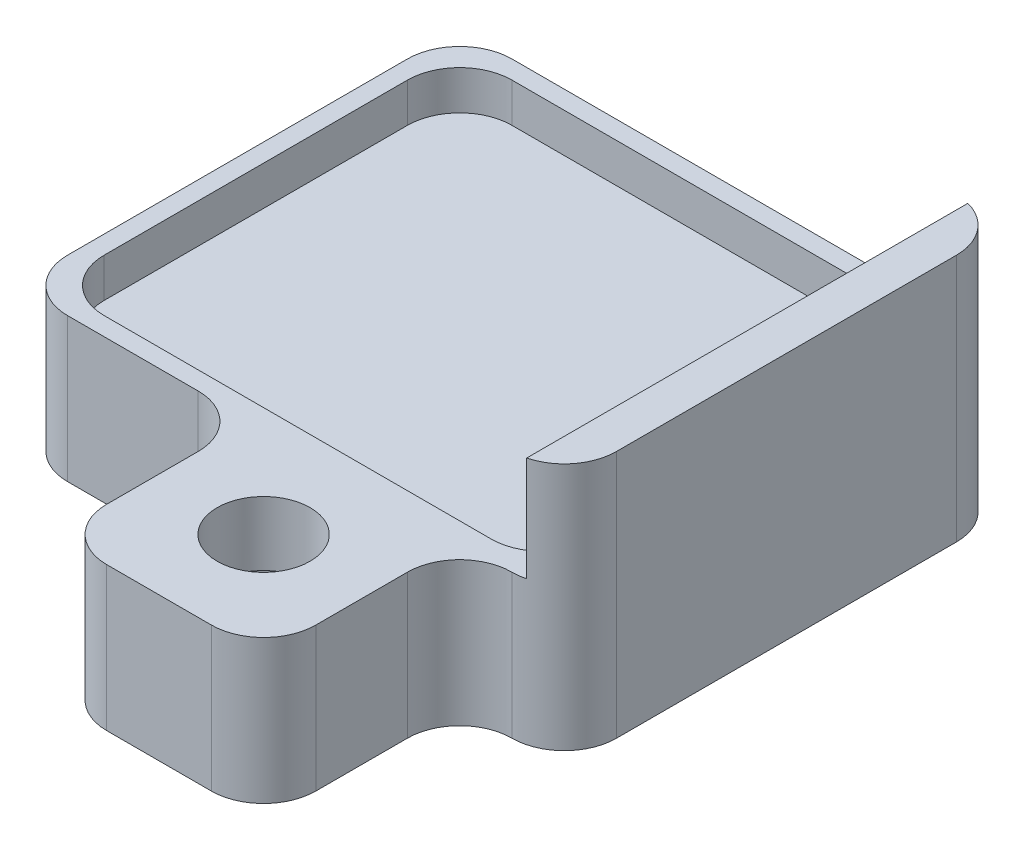
ISO-10303-21;
HEADER;
FILE_DESCRIPTION(('STEP AP214'),'2;1');
FILE_NAME('part.step','',(''),(''),'','','');
FILE_SCHEMA(('AUTOMOTIVE_DESIGN { 1 0 10303 214 1 1 1 1 }'));
ENDSEC;
DATA;
#1=APPLICATION_CONTEXT('core data for automotive mechanical design processes');
#2=APPLICATION_PROTOCOL_DEFINITION('international standard','automotive_design',2000,#1);
#3=PRODUCT_CONTEXT('',#1,'mechanical');
#4=PRODUCT('Part','Part','',(#3));
#5=PRODUCT_RELATED_PRODUCT_CATEGORY('part','',(#4));
#6=PRODUCT_DEFINITION_FORMATION('','',#4);
#7=PRODUCT_DEFINITION_CONTEXT('part definition',#1,'design');
#8=PRODUCT_DEFINITION('design','',#6,#7);
#9=PRODUCT_DEFINITION_SHAPE('','',#8);
#10=(LENGTH_UNIT() NAMED_UNIT(*) SI_UNIT(.MILLI.,.METRE.));
#11=(NAMED_UNIT(*) PLANE_ANGLE_UNIT() SI_UNIT($,.RADIAN.));
#12=(NAMED_UNIT(*) SI_UNIT($,.STERADIAN.) SOLID_ANGLE_UNIT());
#13=UNCERTAINTY_MEASURE_WITH_UNIT(LENGTH_MEASURE(1.E-05),#10,'distance_accuracy_value','');
#14=(GEOMETRIC_REPRESENTATION_CONTEXT(3) GLOBAL_UNCERTAINTY_ASSIGNED_CONTEXT((#13)) GLOBAL_UNIT_ASSIGNED_CONTEXT((#10,
#11,#12)) REPRESENTATION_CONTEXT('',''));
#15=CARTESIAN_POINT('',(0.,0.,0.));
#16=DIRECTION('',(0.,0.,1.));
#17=DIRECTION('',(1.,0.,0.));
#18=AXIS2_PLACEMENT_3D('',#15,#16,#17);
#19=CARTESIAN_POINT('',(-5.25,4.75,4.25));
#20=DIRECTION('',(0.,0.,-1.));
#21=DIRECTION('',(-1.,0.,0.));
#22=AXIS2_PLACEMENT_3D('',#19,#20,#21);
#23=PLANE('',#22);
#24=DIRECTION('',(1.,0.,0.));
#25=VECTOR('',#24,1.);
#26=CARTESIAN_POINT('',(-5.25,0.,4.25));
#27=LINE('',#26,#25);
#28=CARTESIAN_POINT('',(-4.25,0.,4.25));
#29=VERTEX_POINT('',#28);
#30=CARTESIAN_POINT('',(-1.75,0.,4.25));
#31=VERTEX_POINT('',#30);
#32=EDGE_CURVE('E369',#29,#31,#27,.T.);
#33=ORIENTED_EDGE('',*,*,#32,.T.);
#34=DIRECTION('',(0.,-1.,0.));
#35=VECTOR('',#34,1.);
#36=CARTESIAN_POINT('',(-1.75,2.75,4.25));
#37=LINE('',#36,#35);
#38=CARTESIAN_POINT('',(-1.75,2.75,4.25));
#39=VERTEX_POINT('',#38);
#40=EDGE_CURVE('E296',#31,#39,#37,.F.);
#41=ORIENTED_EDGE('',*,*,#40,.T.);
#42=DIRECTION('',(1.,0.,0.));
#43=VECTOR('',#42,1.);
#44=CARTESIAN_POINT('',(-5.25,2.75,4.25));
#45=LINE('',#44,#43);
#46=CARTESIAN_POINT('',(-4.25,2.75,4.25));
#47=VERTEX_POINT('',#46);
#48=EDGE_CURVE('E259',#47,#39,#45,.T.);
#49=ORIENTED_EDGE('',*,*,#48,.F.);
#50=DIRECTION('',(0.,-1.,0.));
#51=VECTOR('',#50,1.);
#52=CARTESIAN_POINT('',(-4.25,4.75,4.25));
#53=LINE('',#52,#51);
#54=EDGE_CURVE('E293',#47,#29,#53,.T.);
#55=ORIENTED_EDGE('',*,*,#54,.T.);
#56=EDGE_LOOP('',(#33,#41,#49,#55));
#57=FACE_BOUND('',#56,.T.);
#58=ADVANCED_FACE('F31',(#57),#23,.F.);
#59=CARTESIAN_POINT('',(-5.25,4.75,4.25));
#60=DIRECTION('',(1.,0.,0.));
#61=DIRECTION('',(0.,0.,-1.));
#62=AXIS2_PLACEMENT_3D('',#59,#60,#61);
#63=PLANE('',#62);
#64=DIRECTION('',(0.,0.,1.));
#65=VECTOR('',#64,1.);
#66=CARTESIAN_POINT('',(-5.25,2.75,-4.25));
#67=LINE('',#66,#65);
#68=CARTESIAN_POINT('',(-5.25,2.75,-3.25));
#69=VERTEX_POINT('',#68);
#70=CARTESIAN_POINT('',(-5.25,2.75,3.25));
#71=VERTEX_POINT('',#70);
#72=EDGE_CURVE('E353',#69,#71,#67,.T.);
#73=ORIENTED_EDGE('',*,*,#72,.F.);
#74=DIRECTION('',(0.,-1.,0.));
#75=VECTOR('',#74,1.);
#76=CARTESIAN_POINT('',(-5.25,4.75,-3.25));
#77=LINE('',#76,#75);
#78=CARTESIAN_POINT('',(-5.25,0.,-3.25));
#79=VERTEX_POINT('',#78);
#80=EDGE_CURVE('E290',#69,#79,#77,.T.);
#81=ORIENTED_EDGE('',*,*,#80,.T.);
#82=DIRECTION('',(0.,0.,1.));
#83=VECTOR('',#82,1.);
#84=CARTESIAN_POINT('',(-5.25,0.,4.25));
#85=LINE('',#84,#83);
#86=CARTESIAN_POINT('',(-5.25,0.,3.25));
#87=VERTEX_POINT('',#86);
#88=EDGE_CURVE('E374',#79,#87,#85,.T.);
#89=ORIENTED_EDGE('',*,*,#88,.T.);
#90=DIRECTION('',(0.,-1.,0.));
#91=VECTOR('',#90,1.);
#92=CARTESIAN_POINT('',(-5.25,4.75,3.25));
#93=LINE('',#92,#91);
#94=EDGE_CURVE('E288',#87,#71,#93,.F.);
#95=ORIENTED_EDGE('',*,*,#94,.T.);
#96=EDGE_LOOP('',(#73,#81,#89,#95));
#97=FACE_BOUND('',#96,.T.);
#98=ADVANCED_FACE('F476',(#97),#63,.F.);
#99=CARTESIAN_POINT('',(5.25,4.75,4.25));
#100=DIRECTION('',(-1.,0.,0.));
#101=DIRECTION('',(0.,0.,1.));
#102=AXIS2_PLACEMENT_3D('',#99,#100,#101);
#103=PLANE('',#102);
#104=DIRECTION('',(0.,0.,-1.));
#105=VECTOR('',#104,1.);
#106=CARTESIAN_POINT('',(5.25,0.,4.25));
#107=LINE('',#106,#105);
#108=CARTESIAN_POINT('',(5.25,0.,3.25));
#109=VERTEX_POINT('',#108);
#110=CARTESIAN_POINT('',(5.25,0.,-3.25));
#111=VERTEX_POINT('',#110);
#112=EDGE_CURVE('E222',#109,#111,#107,.T.);
#113=ORIENTED_EDGE('',*,*,#112,.T.);
#114=DIRECTION('',(0.,-1.,0.));
#115=VECTOR('',#114,1.);
#116=CARTESIAN_POINT('',(5.25,4.75,-3.25));
#117=LINE('',#116,#115);
#118=CARTESIAN_POINT('',(5.25,4.75,-3.25));
#119=VERTEX_POINT('',#118);
#120=EDGE_CURVE('E390',#111,#119,#117,.F.);
#121=ORIENTED_EDGE('',*,*,#120,.T.);
#122=DIRECTION('',(0.,0.,-1.));
#123=VECTOR('',#122,1.);
#124=CARTESIAN_POINT('',(5.25,4.75,4.25));
#125=LINE('',#124,#123);
#126=CARTESIAN_POINT('',(5.25,4.75,3.25));
#127=VERTEX_POINT('',#126);
#128=EDGE_CURVE('E233',#127,#119,#125,.T.);
#129=ORIENTED_EDGE('',*,*,#128,.F.);
#130=DIRECTION('',(0.,-1.,0.));
#131=VECTOR('',#130,1.);
#132=CARTESIAN_POINT('',(5.25,4.75,3.25));
#133=LINE('',#132,#131);
#134=EDGE_CURVE('E387',#127,#109,#133,.T.);
#135=ORIENTED_EDGE('',*,*,#134,.T.);
#136=EDGE_LOOP('',(#113,#121,#129,#135));
#137=FACE_BOUND('',#136,.T.);
#138=ADVANCED_FACE('F411',(#137),#103,.F.);
#139=CARTESIAN_POINT('',(-5.25,4.75,-4.25));
#140=DIRECTION('',(0.,0.,1.));
#141=DIRECTION('',(1.,0.,0.));
#142=AXIS2_PLACEMENT_3D('',#139,#140,#141);
#143=PLANE('',#142);
#144=DIRECTION('',(-1.,0.,0.));
#145=VECTOR('',#144,1.);
#146=CARTESIAN_POINT('',(-5.25,2.75,-4.25));
#147=LINE('',#146,#145);
#148=CARTESIAN_POINT('',(4.25,2.75,-4.25));
#149=VERTEX_POINT('',#148);
#150=CARTESIAN_POINT('',(-4.25,2.75,-4.25));
#151=VERTEX_POINT('',#150);
#152=EDGE_CURVE('E204',#149,#151,#147,.T.);
#153=ORIENTED_EDGE('',*,*,#152,.F.);
#154=DIRECTION('',(0.,-1.,0.));
#155=VECTOR('',#154,1.);
#156=CARTESIAN_POINT('',(4.25,4.75,-4.25));
#157=LINE('',#156,#155);
#158=CARTESIAN_POINT('',(4.25,0.,-4.25));
#159=VERTEX_POINT('',#158);
#160=EDGE_CURVE('E218',#149,#159,#157,.T.);
#161=ORIENTED_EDGE('',*,*,#160,.T.);
#162=DIRECTION('',(-1.,0.,0.));
#163=VECTOR('',#162,1.);
#164=CARTESIAN_POINT('',(-5.25,0.,-4.25));
#165=LINE('',#164,#163);
#166=CARTESIAN_POINT('',(-4.25,0.,-4.25));
#167=VERTEX_POINT('',#166);
#168=EDGE_CURVE('E372',#159,#167,#165,.T.);
#169=ORIENTED_EDGE('',*,*,#168,.T.);
#170=DIRECTION('',(0.,-1.,0.));
#171=VECTOR('',#170,1.);
#172=CARTESIAN_POINT('',(-4.25,4.75,-4.25));
#173=LINE('',#172,#171);
#174=EDGE_CURVE('E221',#167,#151,#173,.F.);
#175=ORIENTED_EDGE('',*,*,#174,.T.);
#176=EDGE_LOOP('',(#153,#161,#169,#175));
#177=FACE_BOUND('',#176,.T.);
#178=ADVANCED_FACE('F216',(#177),#143,.F.);
#179=CARTESIAN_POINT('',(5.25,4.75,-4.25));
#180=DIRECTION('',(0.,-1.,0.));
#181=DIRECTION('',(0.,0.,-1.));
#182=AXIS2_PLACEMENT_3D('',#179,#180,#181);
#183=PLANE('',#182);
#184=ORIENTED_EDGE('',*,*,#128,.T.);
#185=CARTESIAN_POINT('',(4.25,4.75,-3.25));
#186=DIRECTION('',(0.,-1.,0.));
#187=DIRECTION('',(0.,0.,-1.));
#188=AXIS2_PLACEMENT_3D('',#185,#186,#187);
#189=CIRCLE('',#188,1.);
#190=CARTESIAN_POINT('',(4.5,4.75,-4.21824583655185));
#191=VERTEX_POINT('',#190);
#192=EDGE_CURVE('E394',#119,#191,#189,.F.);
#193=ORIENTED_EDGE('',*,*,#192,.T.);
#194=DIRECTION('',(0.,0.,-1.));
#195=VECTOR('',#194,1.);
#196=CARTESIAN_POINT('',(4.5,4.75,-4.25));
#197=LINE('',#196,#195);
#198=CARTESIAN_POINT('',(4.5,4.75,4.21824583655185));
#199=VERTEX_POINT('',#198);
#200=EDGE_CURVE('E349',#199,#191,#197,.T.);
#201=ORIENTED_EDGE('',*,*,#200,.F.);
#202=CARTESIAN_POINT('',(4.25,4.75,3.25));
#203=DIRECTION('',(0.,-1.,0.));
#204=DIRECTION('',(0.,0.,-1.));
#205=AXIS2_PLACEMENT_3D('',#202,#203,#204);
#206=CIRCLE('',#205,1.);
#207=EDGE_CURVE('E392',#199,#127,#206,.F.);
#208=ORIENTED_EDGE('',*,*,#207,.T.);
#209=EDGE_LOOP('',(#184,#193,#201,#208));
#210=FACE_BOUND('',#209,.T.);
#211=ADVANCED_FACE('F406',(#210),#183,.F.);
#212=CARTESIAN_POINT('',(5.25,0.,-4.25));
#213=DIRECTION('',(0.,-1.,0.));
#214=DIRECTION('',(0.,0.,-1.));
#215=AXIS2_PLACEMENT_3D('',#212,#213,#214);
#216=PLANE('',#215);
#217=CARTESIAN_POINT('',(1.25,0.,6.));
#218=DIRECTION('',(0.,-1.,0.));
#219=DIRECTION('',(0.,0.,-1.));
#220=AXIS2_PLACEMENT_3D('',#217,#218,#219);
#221=CIRCLE('',#220,1.5875);
#222=CARTESIAN_POINT('',(1.25,0.,4.4125));
#223=VERTEX_POINT('',#222);
#224=EDGE_CURVE('E741',#223,#223,#221,.T.);
#225=ORIENTED_EDGE('',*,*,#224,.F.);
#226=EDGE_LOOP('',(#225));
#227=FACE_BOUND('',#226,.T.);
#228=ORIENTED_EDGE('',*,*,#168,.F.);
#229=CARTESIAN_POINT('',(4.25,0.,-3.25));
#230=DIRECTION('',(0.,-1.,0.));
#231=DIRECTION('',(0.,0.,-1.));
#232=AXIS2_PLACEMENT_3D('',#229,#230,#231);
#233=CIRCLE('',#232,1.);
#234=EDGE_CURVE('E228',#159,#111,#233,.T.);
#235=ORIENTED_EDGE('',*,*,#234,.T.);
#236=ORIENTED_EDGE('',*,*,#112,.F.);
#237=CARTESIAN_POINT('',(4.25,0.,3.25));
#238=DIRECTION('',(0.,-1.,0.));
#239=DIRECTION('',(0.,0.,-1.));
#240=AXIS2_PLACEMENT_3D('',#237,#238,#239);
#241=CIRCLE('',#240,1.);
#242=CARTESIAN_POINT('',(4.25,0.,4.25));
#243=VERTEX_POINT('',#242);
#244=EDGE_CURVE('E384',#109,#243,#241,.T.);
#245=ORIENTED_EDGE('',*,*,#244,.T.);
#246=CARTESIAN_POINT('',(4.25,0.,5.25));
#247=DIRECTION('',(0.,-1.,0.));
#248=DIRECTION('',(0.,0.,-1.));
#249=AXIS2_PLACEMENT_3D('',#246,#247,#248);
#250=CIRCLE('',#249,1.);
#251=CARTESIAN_POINT('',(3.25,0.,5.25));
#252=VERTEX_POINT('',#251);
#253=EDGE_CURVE('E321',#243,#252,#250,.F.);
#254=ORIENTED_EDGE('',*,*,#253,.T.);
#255=DIRECTION('',(0.,0.,-1.));
#256=VECTOR('',#255,1.);
#257=CARTESIAN_POINT('',(3.25,0.,8.));
#258=LINE('',#257,#256);
#259=CARTESIAN_POINT('',(3.25,0.,7.));
#260=VERTEX_POINT('',#259);
#261=EDGE_CURVE('E237',#260,#252,#258,.T.);
#262=ORIENTED_EDGE('',*,*,#261,.F.);
#263=CARTESIAN_POINT('',(2.25,0.,7.));
#264=DIRECTION('',(0.,-1.,0.));
#265=DIRECTION('',(0.,0.,-1.));
#266=AXIS2_PLACEMENT_3D('',#263,#264,#265);
#267=CIRCLE('',#266,1.);
#268=CARTESIAN_POINT('',(2.25,0.,8.));
#269=VERTEX_POINT('',#268);
#270=EDGE_CURVE('E382',#260,#269,#267,.T.);
#271=ORIENTED_EDGE('',*,*,#270,.T.);
#272=DIRECTION('',(1.,0.,0.));
#273=VECTOR('',#272,1.);
#274=CARTESIAN_POINT('',(-0.749999999999999,0.,8.));
#275=LINE('',#274,#273);
#276=CARTESIAN_POINT('',(0.250000000000001,0.,8.));
#277=VERTEX_POINT('',#276);
#278=EDGE_CURVE('E442',#277,#269,#275,.T.);
#279=ORIENTED_EDGE('',*,*,#278,.F.);
#280=CARTESIAN_POINT('',(0.250000000000001,0.,7.));
#281=DIRECTION('',(0.,-1.,0.));
#282=DIRECTION('',(0.,0.,-1.));
#283=AXIS2_PLACEMENT_3D('',#280,#281,#282);
#284=CIRCLE('',#283,1.);
#285=CARTESIAN_POINT('',(-0.749999999999999,0.,7.));
#286=VERTEX_POINT('',#285);
#287=EDGE_CURVE('E380',#277,#286,#284,.T.);
#288=ORIENTED_EDGE('',*,*,#287,.T.);
#289=DIRECTION('',(0.,0.,-1.));
#290=VECTOR('',#289,1.);
#291=CARTESIAN_POINT('',(-0.749999999999999,0.,8.));
#292=LINE('',#291,#290);
#293=CARTESIAN_POINT('',(-0.749999999999999,0.,5.25));
#294=VERTEX_POINT('',#293);
#295=EDGE_CURVE('E241',#286,#294,#292,.T.);
#296=ORIENTED_EDGE('',*,*,#295,.T.);
#297=CARTESIAN_POINT('',(-1.75,0.,5.25));
#298=DIRECTION('',(0.,-1.,0.));
#299=DIRECTION('',(0.,0.,-1.));
#300=AXIS2_PLACEMENT_3D('',#297,#298,#299);
#301=CIRCLE('',#300,1.);
#302=EDGE_CURVE('E323',#294,#31,#301,.F.);
#303=ORIENTED_EDGE('',*,*,#302,.T.);
#304=ORIENTED_EDGE('',*,*,#32,.F.);
#305=CARTESIAN_POINT('',(-4.25,0.,3.25));
#306=DIRECTION('',(0.,-1.,0.));
#307=DIRECTION('',(0.,0.,-1.));
#308=AXIS2_PLACEMENT_3D('',#305,#306,#307);
#309=CIRCLE('',#308,1.);
#310=EDGE_CURVE('E229',#29,#87,#309,.T.);
#311=ORIENTED_EDGE('',*,*,#310,.T.);
#312=ORIENTED_EDGE('',*,*,#88,.F.);
#313=CARTESIAN_POINT('',(-4.25,0.,-3.25));
#314=DIRECTION('',(0.,-1.,0.));
#315=DIRECTION('',(0.,0.,-1.));
#316=AXIS2_PLACEMENT_3D('',#313,#314,#315);
#317=CIRCLE('',#316,1.);
#318=EDGE_CURVE('E231',#79,#167,#317,.T.);
#319=ORIENTED_EDGE('',*,*,#318,.T.);
#320=EDGE_LOOP('',(#228,#235,#236,#245,#254,#262,#271,#279,#288,#296,#303,#304,#311,#312,#319));
#321=FACE_BOUND('',#320,.T.);
#322=ADVANCED_FACE('F421',(#227,#321),#216,.T.);
#323=CARTESIAN_POINT('',(4.5,2.75,-4.25));
#324=DIRECTION('',(1.,0.,0.));
#325=DIRECTION('',(0.,0.,-1.));
#326=AXIS2_PLACEMENT_3D('',#323,#324,#325);
#327=PLANE('',#326);
#328=ORIENTED_EDGE('',*,*,#200,.T.);
#329=DIRECTION('',(0.,-1.,0.));
#330=VECTOR('',#329,1.);
#331=CARTESIAN_POINT('',(4.5,4.75,-4.21824583655185));
#332=LINE('',#331,#330);
#333=CARTESIAN_POINT('',(4.5,2.75,-4.21824583655185));
#334=VERTEX_POINT('',#333);
#335=EDGE_CURVE('E267',#191,#334,#332,.T.);
#336=ORIENTED_EDGE('',*,*,#335,.T.);
#337=DIRECTION('',(0.,0.,-1.));
#338=VECTOR('',#337,1.);
#339=CARTESIAN_POINT('',(4.5,2.75,-4.25));
#340=LINE('',#339,#338);
#341=CARTESIAN_POINT('',(4.5,2.75,-2.9));
#342=VERTEX_POINT('',#341);
#343=EDGE_CURVE('E207',#342,#334,#340,.T.);
#344=ORIENTED_EDGE('',*,*,#343,.F.);
#345=DIRECTION('',(0.,1.,0.));
#346=VECTOR('',#345,1.);
#347=CARTESIAN_POINT('',(4.5,2.,-2.9));
#348=LINE('',#347,#346);
#349=CARTESIAN_POINT('',(4.5,2.,-2.9));
#350=VERTEX_POINT('',#349);
#351=EDGE_CURVE('E399',#342,#350,#348,.F.);
#352=ORIENTED_EDGE('',*,*,#351,.T.);
#353=DIRECTION('',(0.,0.,-1.));
#354=VECTOR('',#353,1.);
#355=CARTESIAN_POINT('',(4.5,2.,3.9));
#356=LINE('',#355,#354);
#357=CARTESIAN_POINT('',(4.5,2.,2.9));
#358=VERTEX_POINT('',#357);
#359=EDGE_CURVE('E362',#358,#350,#356,.T.);
#360=ORIENTED_EDGE('',*,*,#359,.F.);
#361=DIRECTION('',(0.,1.,0.));
#362=VECTOR('',#361,1.);
#363=CARTESIAN_POINT('',(4.5,2.75,2.9));
#364=LINE('',#363,#362);
#365=CARTESIAN_POINT('',(4.5,2.75,2.9));
#366=VERTEX_POINT('',#365);
#367=EDGE_CURVE('E396',#358,#366,#364,.T.);
#368=ORIENTED_EDGE('',*,*,#367,.T.);
#369=CARTESIAN_POINT('',(4.5,2.75,4.21824583655185));
#370=VERTEX_POINT('',#369);
#371=EDGE_CURVE('E223',#370,#366,#340,.T.);
#372=ORIENTED_EDGE('',*,*,#371,.F.);
#373=DIRECTION('',(0.,-1.,0.));
#374=VECTOR('',#373,1.);
#375=CARTESIAN_POINT('',(4.5,2.75,4.21824583655185));
#376=LINE('',#375,#374);
#377=EDGE_CURVE('E401',#370,#199,#376,.F.);
#378=ORIENTED_EDGE('',*,*,#377,.T.);
#379=EDGE_LOOP('',(#328,#336,#344,#352,#360,#368,#372,#378));
#380=FACE_BOUND('',#379,.T.);
#381=ADVANCED_FACE('F403',(#380),#327,.F.);
#382=CARTESIAN_POINT('',(-5.25,2.75,4.25));
#383=DIRECTION('',(0.,1.,0.));
#384=DIRECTION('',(0.,0.,1.));
#385=AXIS2_PLACEMENT_3D('',#382,#383,#384);
#386=PLANE('',#385);
#387=CARTESIAN_POINT('',(1.25,2.75,6.));
#388=DIRECTION('',(0.,1.,0.));
#389=DIRECTION('',(0.,0.,1.));
#390=AXIS2_PLACEMENT_3D('',#387,#388,#389);
#391=CIRCLE('',#390,0.888999999999999);
#392=CARTESIAN_POINT('',(1.25,2.75,6.889));
#393=VERTEX_POINT('',#392);
#394=EDGE_CURVE('E252',#393,#393,#391,.T.);
#395=ORIENTED_EDGE('',*,*,#394,.F.);
#396=EDGE_LOOP('',(#395));
#397=FACE_BOUND('',#396,.T.);
#398=ORIENTED_EDGE('',*,*,#343,.T.);
#399=CARTESIAN_POINT('',(4.25,2.75,-3.25));
#400=DIRECTION('',(0.,1.,0.));
#401=DIRECTION('',(0.,0.,1.));
#402=AXIS2_PLACEMENT_3D('',#399,#400,#401);
#403=CIRCLE('',#402,1.);
#404=EDGE_CURVE('E201',#334,#149,#403,.T.);
#405=ORIENTED_EDGE('',*,*,#404,.T.);
#406=ORIENTED_EDGE('',*,*,#152,.T.);
#407=CARTESIAN_POINT('',(-4.25,2.75,-3.25));
#408=DIRECTION('',(0.,1.,0.));
#409=DIRECTION('',(0.,0.,1.));
#410=AXIS2_PLACEMENT_3D('',#407,#408,#409);
#411=CIRCLE('',#410,1.);
#412=EDGE_CURVE('E266',#151,#69,#411,.T.);
#413=ORIENTED_EDGE('',*,*,#412,.T.);
#414=ORIENTED_EDGE('',*,*,#72,.T.);
#415=CARTESIAN_POINT('',(-4.25,2.75,3.25));
#416=DIRECTION('',(0.,1.,0.));
#417=DIRECTION('',(0.,0.,1.));
#418=AXIS2_PLACEMENT_3D('',#415,#416,#417);
#419=CIRCLE('',#418,1.);
#420=EDGE_CURVE('E264',#71,#47,#419,.T.);
#421=ORIENTED_EDGE('',*,*,#420,.T.);
#422=ORIENTED_EDGE('',*,*,#48,.T.);
#423=CARTESIAN_POINT('',(-1.75,2.75,5.25));
#424=DIRECTION('',(0.,1.,0.));
#425=DIRECTION('',(0.,0.,1.));
#426=AXIS2_PLACEMENT_3D('',#423,#424,#425);
#427=CIRCLE('',#426,1.);
#428=CARTESIAN_POINT('',(-0.749999999999999,2.75,5.25));
#429=VERTEX_POINT('',#428);
#430=EDGE_CURVE('E325',#39,#429,#427,.F.);
#431=ORIENTED_EDGE('',*,*,#430,.T.);
#432=DIRECTION('',(0.,0.,-1.));
#433=VECTOR('',#432,1.);
#434=CARTESIAN_POINT('',(-0.749999999999999,2.75,8.));
#435=LINE('',#434,#433);
#436=CARTESIAN_POINT('',(-0.749999999999999,2.75,7.));
#437=VERTEX_POINT('',#436);
#438=EDGE_CURVE('E254',#437,#429,#435,.T.);
#439=ORIENTED_EDGE('',*,*,#438,.F.);
#440=CARTESIAN_POINT('',(0.250000000000001,2.75,7.));
#441=DIRECTION('',(0.,1.,0.));
#442=DIRECTION('',(0.,0.,1.));
#443=AXIS2_PLACEMENT_3D('',#440,#441,#442);
#444=CIRCLE('',#443,1.);
#445=CARTESIAN_POINT('',(0.250000000000001,2.75,8.));
#446=VERTEX_POINT('',#445);
#447=EDGE_CURVE('E269',#437,#446,#444,.T.);
#448=ORIENTED_EDGE('',*,*,#447,.T.);
#449=DIRECTION('',(-1.,0.,0.));
#450=VECTOR('',#449,1.);
#451=CARTESIAN_POINT('',(-0.749999999999999,2.75,8.));
#452=LINE('',#451,#450);
#453=CARTESIAN_POINT('',(2.25,2.75,8.));
#454=VERTEX_POINT('',#453);
#455=EDGE_CURVE('E258',#454,#446,#452,.T.);
#456=ORIENTED_EDGE('',*,*,#455,.F.);
#457=CARTESIAN_POINT('',(2.25,2.75,7.));
#458=DIRECTION('',(0.,1.,0.));
#459=DIRECTION('',(0.,0.,1.));
#460=AXIS2_PLACEMENT_3D('',#457,#458,#459);
#461=CIRCLE('',#460,1.);
#462=CARTESIAN_POINT('',(3.25,2.75,7.));
#463=VERTEX_POINT('',#462);
#464=EDGE_CURVE('E271',#454,#463,#461,.T.);
#465=ORIENTED_EDGE('',*,*,#464,.T.);
#466=DIRECTION('',(0.,0.,-1.));
#467=VECTOR('',#466,1.);
#468=CARTESIAN_POINT('',(3.25,2.75,8.));
#469=LINE('',#468,#467);
#470=CARTESIAN_POINT('',(3.25,2.75,5.25));
#471=VERTEX_POINT('',#470);
#472=EDGE_CURVE('E242',#463,#471,#469,.T.);
#473=ORIENTED_EDGE('',*,*,#472,.T.);
#474=CARTESIAN_POINT('',(4.25,2.75,5.25));
#475=DIRECTION('',(0.,1.,0.));
#476=DIRECTION('',(0.,0.,1.));
#477=AXIS2_PLACEMENT_3D('',#474,#475,#476);
#478=CIRCLE('',#477,1.);
#479=CARTESIAN_POINT('',(4.25,2.75,4.25));
#480=VERTEX_POINT('',#479);
#481=EDGE_CURVE('E319',#471,#480,#478,.F.);
#482=ORIENTED_EDGE('',*,*,#481,.T.);
#483=CARTESIAN_POINT('',(4.25,2.75,3.25));
#484=DIRECTION('',(0.,1.,0.));
#485=DIRECTION('',(0.,0.,1.));
#486=AXIS2_PLACEMENT_3D('',#483,#484,#485);
#487=CIRCLE('',#486,1.);
#488=EDGE_CURVE('E212',#480,#370,#487,.T.);
#489=ORIENTED_EDGE('',*,*,#488,.T.);
#490=ORIENTED_EDGE('',*,*,#371,.T.);
#491=CARTESIAN_POINT('',(3.5,2.75,2.9));
#492=DIRECTION('',(0.,1.,0.));
#493=DIRECTION('',(0.,0.,1.));
#494=AXIS2_PLACEMENT_3D('',#491,#492,#493);
#495=CIRCLE('',#494,1.);
#496=CARTESIAN_POINT('',(3.5,2.75,3.9));
#497=VERTEX_POINT('',#496);
#498=EDGE_CURVE('E11',#366,#497,#495,.F.);
#499=ORIENTED_EDGE('',*,*,#498,.T.);
#500=DIRECTION('',(1.,0.,0.));
#501=VECTOR('',#500,1.);
#502=CARTESIAN_POINT('',(-4.9,2.75,3.9));
#503=LINE('',#502,#501);
#504=CARTESIAN_POINT('',(-3.9,2.75,3.9));
#505=VERTEX_POINT('',#504);
#506=EDGE_CURVE('E335',#505,#497,#503,.T.);
#507=ORIENTED_EDGE('',*,*,#506,.F.);
#508=CARTESIAN_POINT('',(-3.9,2.75,2.9));
#509=DIRECTION('',(0.,1.,0.));
#510=DIRECTION('',(0.,0.,1.));
#511=AXIS2_PLACEMENT_3D('',#508,#509,#510);
#512=CIRCLE('',#511,1.);
#513=CARTESIAN_POINT('',(-4.9,2.75,2.9));
#514=VERTEX_POINT('',#513);
#515=EDGE_CURVE('E40',#505,#514,#512,.F.);
#516=ORIENTED_EDGE('',*,*,#515,.T.);
#517=DIRECTION('',(0.,0.,1.));
#518=VECTOR('',#517,1.);
#519=CARTESIAN_POINT('',(-4.9,2.75,3.9));
#520=LINE('',#519,#518);
#521=CARTESIAN_POINT('',(-4.9,2.75,-2.9));
#522=VERTEX_POINT('',#521);
#523=EDGE_CURVE('E334',#522,#514,#520,.T.);
#524=ORIENTED_EDGE('',*,*,#523,.F.);
#525=CARTESIAN_POINT('',(-3.9,2.75,-2.9));
#526=DIRECTION('',(0.,1.,0.));
#527=DIRECTION('',(0.,0.,1.));
#528=AXIS2_PLACEMENT_3D('',#525,#526,#527);
#529=CIRCLE('',#528,1.);
#530=CARTESIAN_POINT('',(-3.9,2.75,-3.9));
#531=VERTEX_POINT('',#530);
#532=EDGE_CURVE('E329',#522,#531,#529,.F.);
#533=ORIENTED_EDGE('',*,*,#532,.T.);
#534=DIRECTION('',(-1.,0.,0.));
#535=VECTOR('',#534,1.);
#536=CARTESIAN_POINT('',(-4.9,2.75,-3.9));
#537=LINE('',#536,#535);
#538=CARTESIAN_POINT('',(3.5,2.75,-3.9));
#539=VERTEX_POINT('',#538);
#540=EDGE_CURVE('E343',#539,#531,#537,.T.);
#541=ORIENTED_EDGE('',*,*,#540,.F.);
#542=CARTESIAN_POINT('',(3.5,2.75,-2.9));
#543=DIRECTION('',(0.,1.,0.));
#544=DIRECTION('',(0.,0.,1.));
#545=AXIS2_PLACEMENT_3D('',#542,#543,#544);
#546=CIRCLE('',#545,1.);
#547=EDGE_CURVE('E327',#539,#342,#546,.F.);
#548=ORIENTED_EDGE('',*,*,#547,.T.);
#549=EDGE_LOOP('',(#398,#405,#406,#413,#414,#421,#422,#431,#439,#448,#456,#465,#473,#482,#489,
#490,#499,#507,#516,#524,#533,#541,#548));
#550=FACE_BOUND('',#549,.T.);
#551=ADVANCED_FACE('F203',(#397,#550),#386,.T.);
#552=CARTESIAN_POINT('',(-4.9,2.,3.9));
#553=DIRECTION('',(0.,0.,1.));
#554=DIRECTION('',(1.,0.,0.));
#555=AXIS2_PLACEMENT_3D('',#552,#553,#554);
#556=PLANE('',#555);
#557=DIRECTION('',(1.,0.,0.));
#558=VECTOR('',#557,1.);
#559=CARTESIAN_POINT('',(-4.9,2.,3.9));
#560=LINE('',#559,#558);
#561=CARTESIAN_POINT('',(-3.9,2.,3.9));
#562=VERTEX_POINT('',#561);
#563=CARTESIAN_POINT('',(3.5,2.,3.9));
#564=VERTEX_POINT('',#563);
#565=EDGE_CURVE('E347',#562,#564,#560,.T.);
#566=ORIENTED_EDGE('',*,*,#565,.F.);
#567=DIRECTION('',(0.,1.,0.));
#568=VECTOR('',#567,1.);
#569=CARTESIAN_POINT('',(-3.9,2.75,3.9));
#570=LINE('',#569,#568);
#571=EDGE_CURVE('E316',#562,#505,#570,.T.);
#572=ORIENTED_EDGE('',*,*,#571,.T.);
#573=ORIENTED_EDGE('',*,*,#506,.T.);
#574=DIRECTION('',(0.,1.,0.));
#575=VECTOR('',#574,1.);
#576=CARTESIAN_POINT('',(3.5,2.,3.9));
#577=LINE('',#576,#575);
#578=EDGE_CURVE('E47',#497,#564,#577,.F.);
#579=ORIENTED_EDGE('',*,*,#578,.T.);
#580=EDGE_LOOP('',(#566,#572,#573,#579));
#581=FACE_BOUND('',#580,.T.);
#582=ADVANCED_FACE('F346',(#581),#556,.F.);
#583=CARTESIAN_POINT('',(-4.9,2.,3.9));
#584=DIRECTION('',(-1.,0.,0.));
#585=DIRECTION('',(0.,0.,1.));
#586=AXIS2_PLACEMENT_3D('',#583,#584,#585);
#587=PLANE('',#586);
#588=DIRECTION('',(0.,0.,1.));
#589=VECTOR('',#588,1.);
#590=CARTESIAN_POINT('',(-4.9,2.,3.9));
#591=LINE('',#590,#589);
#592=CARTESIAN_POINT('',(-4.9,2.,-2.9));
#593=VERTEX_POINT('',#592);
#594=CARTESIAN_POINT('',(-4.9,2.,2.9));
#595=VERTEX_POINT('',#594);
#596=EDGE_CURVE('E350',#593,#595,#591,.T.);
#597=ORIENTED_EDGE('',*,*,#596,.F.);
#598=DIRECTION('',(0.,1.,0.));
#599=VECTOR('',#598,1.);
#600=CARTESIAN_POINT('',(-4.9,2.75,-2.9));
#601=LINE('',#600,#599);
#602=EDGE_CURVE('E312',#593,#522,#601,.T.);
#603=ORIENTED_EDGE('',*,*,#602,.T.);
#604=ORIENTED_EDGE('',*,*,#523,.T.);
#605=DIRECTION('',(0.,1.,0.));
#606=VECTOR('',#605,1.);
#607=CARTESIAN_POINT('',(-4.9,2.,2.9));
#608=LINE('',#607,#606);
#609=EDGE_CURVE('E310',#514,#595,#608,.F.);
#610=ORIENTED_EDGE('',*,*,#609,.T.);
#611=EDGE_LOOP('',(#597,#603,#604,#610));
#612=FACE_BOUND('',#611,.T.);
#613=ADVANCED_FACE('F341',(#612),#587,.F.);
#614=CARTESIAN_POINT('',(-4.9,2.,-3.9));
#615=DIRECTION('',(0.,0.,-1.));
#616=DIRECTION('',(-1.,0.,0.));
#617=AXIS2_PLACEMENT_3D('',#614,#615,#616);
#618=PLANE('',#617);
#619=DIRECTION('',(-1.,0.,0.));
#620=VECTOR('',#619,1.);
#621=CARTESIAN_POINT('',(-4.9,2.,-3.9));
#622=LINE('',#621,#620);
#623=CARTESIAN_POINT('',(3.5,2.,-3.9));
#624=VERTEX_POINT('',#623);
#625=CARTESIAN_POINT('',(-3.9,2.,-3.9));
#626=VERTEX_POINT('',#625);
#627=EDGE_CURVE('E355',#624,#626,#622,.T.);
#628=ORIENTED_EDGE('',*,*,#627,.F.);
#629=DIRECTION('',(0.,1.,0.));
#630=VECTOR('',#629,1.);
#631=CARTESIAN_POINT('',(3.5,2.75,-3.9));
#632=LINE('',#631,#630);
#633=EDGE_CURVE('E300',#624,#539,#632,.T.);
#634=ORIENTED_EDGE('',*,*,#633,.T.);
#635=ORIENTED_EDGE('',*,*,#540,.T.);
#636=DIRECTION('',(0.,1.,0.));
#637=VECTOR('',#636,1.);
#638=CARTESIAN_POINT('',(-3.9,2.,-3.9));
#639=LINE('',#638,#637);
#640=EDGE_CURVE('E298',#531,#626,#639,.F.);
#641=ORIENTED_EDGE('',*,*,#640,.T.);
#642=EDGE_LOOP('',(#628,#634,#635,#641));
#643=FACE_BOUND('',#642,.T.);
#644=ADVANCED_FACE('F462',(#643),#618,.F.);
#645=CARTESIAN_POINT('',(4.5,2.,-3.9));
#646=DIRECTION('',(0.,-1.,0.));
#647=DIRECTION('',(0.,0.,-1.));
#648=AXIS2_PLACEMENT_3D('',#645,#646,#647);
#649=PLANE('',#648);
#650=ORIENTED_EDGE('',*,*,#359,.T.);
#651=CARTESIAN_POINT('',(3.5,2.,-2.9));
#652=DIRECTION('',(0.,-1.,0.));
#653=DIRECTION('',(0.,0.,-1.));
#654=AXIS2_PLACEMENT_3D('',#651,#652,#653);
#655=CIRCLE('',#654,1.);
#656=EDGE_CURVE('E308',#350,#624,#655,.F.);
#657=ORIENTED_EDGE('',*,*,#656,.T.);
#658=ORIENTED_EDGE('',*,*,#627,.T.);
#659=CARTESIAN_POINT('',(-3.9,2.,-2.9));
#660=DIRECTION('',(0.,-1.,0.));
#661=DIRECTION('',(0.,0.,-1.));
#662=AXIS2_PLACEMENT_3D('',#659,#660,#661);
#663=CIRCLE('',#662,1.);
#664=EDGE_CURVE('E306',#626,#593,#663,.F.);
#665=ORIENTED_EDGE('',*,*,#664,.T.);
#666=ORIENTED_EDGE('',*,*,#596,.T.);
#667=CARTESIAN_POINT('',(-3.9,2.,2.9));
#668=DIRECTION('',(0.,-1.,0.));
#669=DIRECTION('',(0.,0.,-1.));
#670=AXIS2_PLACEMENT_3D('',#667,#668,#669);
#671=CIRCLE('',#670,1.);
#672=EDGE_CURVE('E54',#595,#562,#671,.F.);
#673=ORIENTED_EDGE('',*,*,#672,.T.);
#674=ORIENTED_EDGE('',*,*,#565,.T.);
#675=CARTESIAN_POINT('',(3.5,2.,2.9));
#676=DIRECTION('',(0.,-1.,0.));
#677=DIRECTION('',(0.,0.,-1.));
#678=AXIS2_PLACEMENT_3D('',#675,#676,#677);
#679=CIRCLE('',#678,1.);
#680=EDGE_CURVE('E303',#564,#358,#679,.F.);
#681=ORIENTED_EDGE('',*,*,#680,.T.);
#682=EDGE_LOOP('',(#650,#657,#658,#665,#666,#673,#674,#681));
#683=FACE_BOUND('',#682,.T.);
#684=ADVANCED_FACE('F454',(#683),#649,.F.);
#685=CARTESIAN_POINT('',(-0.749999999999999,2.75,8.));
#686=DIRECTION('',(1.,0.,0.));
#687=DIRECTION('',(0.,1.,0.));
#688=AXIS2_PLACEMENT_3D('',#685,#686,#687);
#689=PLANE('',#688);
#690=ORIENTED_EDGE('',*,*,#295,.F.);
#691=DIRECTION('',(0.,-1.,0.));
#692=VECTOR('',#691,1.);
#693=CARTESIAN_POINT('',(-0.749999999999999,2.75,7.));
#694=LINE('',#693,#692);
#695=EDGE_CURVE('E286',#286,#437,#694,.F.);
#696=ORIENTED_EDGE('',*,*,#695,.T.);
#697=ORIENTED_EDGE('',*,*,#438,.T.);
#698=DIRECTION('',(0.,-1.,0.));
#699=VECTOR('',#698,1.);
#700=CARTESIAN_POINT('',(-0.749999999999999,0.,5.25));
#701=LINE('',#700,#699);
#702=EDGE_CURVE('E283',#429,#294,#701,.T.);
#703=ORIENTED_EDGE('',*,*,#702,.T.);
#704=EDGE_LOOP('',(#690,#696,#697,#703));
#705=FACE_BOUND('',#704,.T.);
#706=ADVANCED_FACE('F620',(#705),#689,.F.);
#707=CARTESIAN_POINT('',(3.25,2.75,8.));
#708=DIRECTION('',(-1.,0.,0.));
#709=DIRECTION('',(0.,-1.,0.));
#710=AXIS2_PLACEMENT_3D('',#707,#708,#709);
#711=PLANE('',#710);
#712=ORIENTED_EDGE('',*,*,#261,.T.);
#713=DIRECTION('',(0.,1.,0.));
#714=VECTOR('',#713,1.);
#715=CARTESIAN_POINT('',(3.25,2.75,5.25));
#716=LINE('',#715,#714);
#717=EDGE_CURVE('E275',#252,#471,#716,.T.);
#718=ORIENTED_EDGE('',*,*,#717,.T.);
#719=ORIENTED_EDGE('',*,*,#472,.F.);
#720=DIRECTION('',(0.,1.,0.));
#721=VECTOR('',#720,1.);
#722=CARTESIAN_POINT('',(3.25,0.,7.));
#723=LINE('',#722,#721);
#724=EDGE_CURVE('E211',#463,#260,#723,.F.);
#725=ORIENTED_EDGE('',*,*,#724,.T.);
#726=EDGE_LOOP('',(#712,#718,#719,#725));
#727=FACE_BOUND('',#726,.T.);
#728=ADVANCED_FACE('F429',(#727),#711,.F.);
#729=CARTESIAN_POINT('',(-0.749999999999999,0.,8.));
#730=DIRECTION('',(0.,0.,1.));
#731=DIRECTION('',(1.,0.,0.));
#732=AXIS2_PLACEMENT_3D('',#729,#730,#731);
#733=PLANE('',#732);
#734=ORIENTED_EDGE('',*,*,#278,.T.);
#735=DIRECTION('',(0.,1.,0.));
#736=VECTOR('',#735,1.);
#737=CARTESIAN_POINT('',(2.25,2.75,8.));
#738=LINE('',#737,#736);
#739=EDGE_CURVE('E280',#269,#454,#738,.T.);
#740=ORIENTED_EDGE('',*,*,#739,.T.);
#741=ORIENTED_EDGE('',*,*,#455,.T.);
#742=DIRECTION('',(0.,-1.,0.));
#743=VECTOR('',#742,1.);
#744=CARTESIAN_POINT('',(0.250000000000001,0.,8.));
#745=LINE('',#744,#743);
#746=EDGE_CURVE('E277',#446,#277,#745,.T.);
#747=ORIENTED_EDGE('',*,*,#746,.T.);
#748=EDGE_LOOP('',(#734,#740,#741,#747));
#749=FACE_BOUND('',#748,.T.);
#750=ADVANCED_FACE('F439',(#749),#733,.T.);
#751=CARTESIAN_POINT('',(1.25,0.,6.));
#752=DIRECTION('',(0.,-1.,0.));
#753=DIRECTION('',(0.,0.,-1.));
#754=AXIS2_PLACEMENT_3D('',#751,#752,#753);
#755=CYLINDRICAL_SURFACE('',#754,0.888999999999999);
#756=ORIENTED_EDGE('',*,*,#394,.T.);
#757=EDGE_LOOP('',(#756));
#758=FACE_BOUND('',#757,.T.);
#759=CARTESIAN_POINT('',(1.25,1.524,6.));
#760=DIRECTION('',(0.,-1.,0.));
#761=DIRECTION('',(0.,0.,-1.));
#762=AXIS2_PLACEMENT_3D('',#759,#760,#761);
#763=CIRCLE('',#762,0.889);
#764=CARTESIAN_POINT('',(1.25,1.524,5.111));
#765=VERTEX_POINT('',#764);
#766=EDGE_CURVE('E446',#765,#765,#763,.T.);
#767=ORIENTED_EDGE('',*,*,#766,.T.);
#768=EDGE_LOOP('',(#767));
#769=FACE_BOUND('',#768,.T.);
#770=ADVANCED_FACE('F597',(#758,#769),#755,.F.);
#771=CARTESIAN_POINT('',(2.139,1.524,6.));
#772=DIRECTION('',(0.,1.,0.));
#773=DIRECTION('',(0.,0.,1.));
#774=AXIS2_PLACEMENT_3D('',#771,#772,#773);
#775=PLANE('',#774);
#776=ORIENTED_EDGE('',*,*,#766,.F.);
#777=EDGE_LOOP('',(#776));
#778=FACE_BOUND('',#777,.T.);
#779=CARTESIAN_POINT('',(1.25,1.524,6.));
#780=DIRECTION('',(0.,-1.,0.));
#781=DIRECTION('',(0.,0.,-1.));
#782=AXIS2_PLACEMENT_3D('',#779,#780,#781);
#783=CIRCLE('',#782,1.5875);
#784=CARTESIAN_POINT('',(1.25,1.524,4.4125));
#785=VERTEX_POINT('',#784);
#786=EDGE_CURVE('E743',#785,#785,#783,.T.);
#787=ORIENTED_EDGE('',*,*,#786,.T.);
#788=EDGE_LOOP('',(#787));
#789=FACE_BOUND('',#788,.T.);
#790=ADVANCED_FACE('F588',(#778,#789),#775,.F.);
#791=CARTESIAN_POINT('',(1.25,0.,6.));
#792=DIRECTION('',(0.,-1.,0.));
#793=DIRECTION('',(0.,0.,-1.));
#794=AXIS2_PLACEMENT_3D('',#791,#792,#793);
#795=CYLINDRICAL_SURFACE('',#794,1.5875);
#796=ORIENTED_EDGE('',*,*,#786,.F.);
#797=EDGE_LOOP('',(#796));
#798=FACE_BOUND('',#797,.T.);
#799=ORIENTED_EDGE('',*,*,#224,.T.);
#800=EDGE_LOOP('',(#799));
#801=FACE_BOUND('',#800,.T.);
#802=ADVANCED_FACE('F493',(#798,#801),#795,.F.);
#803=CARTESIAN_POINT('',(4.25,4.75,-3.25));
#804=DIRECTION('',(0.,-1.,0.));
#805=DIRECTION('',(0.,0.,-1.));
#806=AXIS2_PLACEMENT_3D('',#803,#804,#805);
#807=CYLINDRICAL_SURFACE('',#806,1.);
#808=ORIENTED_EDGE('',*,*,#192,.F.);
#809=ORIENTED_EDGE('',*,*,#120,.F.);
#810=ORIENTED_EDGE('',*,*,#234,.F.);
#811=ORIENTED_EDGE('',*,*,#160,.F.);
#812=ORIENTED_EDGE('',*,*,#404,.F.);
#813=ORIENTED_EDGE('',*,*,#335,.F.);
#814=EDGE_LOOP('',(#808,#809,#810,#811,#812,#813));
#815=FACE_BOUND('',#814,.T.);
#816=ADVANCED_FACE('F226',(#815),#807,.T.);
#817=CARTESIAN_POINT('',(4.25,2.75,5.25));
#818=DIRECTION('',(0.,-1.,0.));
#819=DIRECTION('',(1.,0.,0.));
#820=AXIS2_PLACEMENT_3D('',#817,#818,#819);
#821=CYLINDRICAL_SURFACE('',#820,1.);
#822=DIRECTION('',(0.,1.,0.));
#823=VECTOR('',#822,1.);
#824=CARTESIAN_POINT('',(4.25,0.,4.25));
#825=LINE('',#824,#823);
#826=EDGE_CURVE('E35',#480,#243,#825,.F.);
#827=ORIENTED_EDGE('',*,*,#826,.F.);
#828=ORIENTED_EDGE('',*,*,#481,.F.);
#829=ORIENTED_EDGE('',*,*,#717,.F.);
#830=ORIENTED_EDGE('',*,*,#253,.F.);
#831=EDGE_LOOP('',(#827,#828,#829,#830));
#832=FACE_BOUND('',#831,.T.);
#833=ADVANCED_FACE('F425',(#832),#821,.F.);
#834=CARTESIAN_POINT('',(4.25,4.75,3.25));
#835=DIRECTION('',(0.,-1.,0.));
#836=DIRECTION('',(0.,0.,-1.));
#837=AXIS2_PLACEMENT_3D('',#834,#835,#836);
#838=CYLINDRICAL_SURFACE('',#837,1.);
#839=ORIENTED_EDGE('',*,*,#488,.F.);
#840=ORIENTED_EDGE('',*,*,#826,.T.);
#841=ORIENTED_EDGE('',*,*,#244,.F.);
#842=ORIENTED_EDGE('',*,*,#134,.F.);
#843=ORIENTED_EDGE('',*,*,#207,.F.);
#844=ORIENTED_EDGE('',*,*,#377,.F.);
#845=EDGE_LOOP('',(#839,#840,#841,#842,#843,#844));
#846=FACE_BOUND('',#845,.T.);
#847=ADVANCED_FACE('F415',(#846),#838,.T.);
#848=CARTESIAN_POINT('',(2.25,0.,7.));
#849=DIRECTION('',(0.,-1.,0.));
#850=DIRECTION('',(1.,0.,0.));
#851=AXIS2_PLACEMENT_3D('',#848,#849,#850);
#852=CYLINDRICAL_SURFACE('',#851,1.);
#853=ORIENTED_EDGE('',*,*,#270,.F.);
#854=ORIENTED_EDGE('',*,*,#724,.F.);
#855=ORIENTED_EDGE('',*,*,#464,.F.);
#856=ORIENTED_EDGE('',*,*,#739,.F.);
#857=EDGE_LOOP('',(#853,#854,#855,#856));
#858=FACE_BOUND('',#857,.T.);
#859=ADVANCED_FACE('F436',(#858),#852,.T.);
#860=CARTESIAN_POINT('',(0.250000000000001,0.,7.));
#861=DIRECTION('',(0.,1.,0.));
#862=DIRECTION('',(-1.,0.,0.));
#863=AXIS2_PLACEMENT_3D('',#860,#861,#862);
#864=CYLINDRICAL_SURFACE('',#863,1.);
#865=ORIENTED_EDGE('',*,*,#447,.F.);
#866=ORIENTED_EDGE('',*,*,#695,.F.);
#867=ORIENTED_EDGE('',*,*,#287,.F.);
#868=ORIENTED_EDGE('',*,*,#746,.F.);
#869=EDGE_LOOP('',(#865,#866,#867,#868));
#870=FACE_BOUND('',#869,.T.);
#871=ADVANCED_FACE('F500',(#870),#864,.T.);
#872=CARTESIAN_POINT('',(-4.25,4.75,-3.25));
#873=DIRECTION('',(0.,-1.,0.));
#874=DIRECTION('',(0.,0.,-1.));
#875=AXIS2_PLACEMENT_3D('',#872,#873,#874);
#876=CYLINDRICAL_SURFACE('',#875,1.);
#877=ORIENTED_EDGE('',*,*,#412,.F.);
#878=ORIENTED_EDGE('',*,*,#174,.F.);
#879=ORIENTED_EDGE('',*,*,#318,.F.);
#880=ORIENTED_EDGE('',*,*,#80,.F.);
#881=EDGE_LOOP('',(#877,#878,#879,#880));
#882=FACE_BOUND('',#881,.T.);
#883=ADVANCED_FACE('F503',(#882),#876,.T.);
#884=CARTESIAN_POINT('',(-1.75,2.75,5.25));
#885=DIRECTION('',(0.,1.,0.));
#886=DIRECTION('',(-1.,0.,0.));
#887=AXIS2_PLACEMENT_3D('',#884,#885,#886);
#888=CYLINDRICAL_SURFACE('',#887,1.);
#889=ORIENTED_EDGE('',*,*,#430,.F.);
#890=ORIENTED_EDGE('',*,*,#40,.F.);
#891=ORIENTED_EDGE('',*,*,#302,.F.);
#892=ORIENTED_EDGE('',*,*,#702,.F.);
#893=EDGE_LOOP('',(#889,#890,#891,#892));
#894=FACE_BOUND('',#893,.T.);
#895=ADVANCED_FACE('F507',(#894),#888,.F.);
#896=CARTESIAN_POINT('',(-4.25,4.75,3.25));
#897=DIRECTION('',(0.,-1.,0.));
#898=DIRECTION('',(0.,0.,-1.));
#899=AXIS2_PLACEMENT_3D('',#896,#897,#898);
#900=CYLINDRICAL_SURFACE('',#899,1.);
#901=ORIENTED_EDGE('',*,*,#420,.F.);
#902=ORIENTED_EDGE('',*,*,#94,.F.);
#903=ORIENTED_EDGE('',*,*,#310,.F.);
#904=ORIENTED_EDGE('',*,*,#54,.F.);
#905=EDGE_LOOP('',(#901,#902,#903,#904));
#906=FACE_BOUND('',#905,.T.);
#907=ADVANCED_FACE('F511',(#906),#900,.T.);
#908=CARTESIAN_POINT('',(3.5,2.,-2.9));
#909=DIRECTION('',(0.,-1.,0.));
#910=DIRECTION('',(0.,0.,-1.));
#911=AXIS2_PLACEMENT_3D('',#908,#909,#910);
#912=CYLINDRICAL_SURFACE('',#911,1.);
#913=ORIENTED_EDGE('',*,*,#656,.F.);
#914=ORIENTED_EDGE('',*,*,#351,.F.);
#915=ORIENTED_EDGE('',*,*,#547,.F.);
#916=ORIENTED_EDGE('',*,*,#633,.F.);
#917=EDGE_LOOP('',(#913,#914,#915,#916));
#918=FACE_BOUND('',#917,.T.);
#919=ADVANCED_FACE('F464',(#918),#912,.F.);
#920=CARTESIAN_POINT('',(-3.9,2.,-2.9));
#921=DIRECTION('',(0.,-1.,0.));
#922=DIRECTION('',(0.,0.,-1.));
#923=AXIS2_PLACEMENT_3D('',#920,#921,#922);
#924=CYLINDRICAL_SURFACE('',#923,1.);
#925=ORIENTED_EDGE('',*,*,#664,.F.);
#926=ORIENTED_EDGE('',*,*,#640,.F.);
#927=ORIENTED_EDGE('',*,*,#532,.F.);
#928=ORIENTED_EDGE('',*,*,#602,.F.);
#929=EDGE_LOOP('',(#925,#926,#927,#928));
#930=FACE_BOUND('',#929,.T.);
#931=ADVANCED_FACE('F460',(#930),#924,.F.);
#932=CARTESIAN_POINT('',(-3.9,2.,2.9));
#933=DIRECTION('',(0.,-1.,0.));
#934=DIRECTION('',(0.,0.,-1.));
#935=AXIS2_PLACEMENT_3D('',#932,#933,#934);
#936=CYLINDRICAL_SURFACE('',#935,1.);
#937=ORIENTED_EDGE('',*,*,#672,.F.);
#938=ORIENTED_EDGE('',*,*,#609,.F.);
#939=ORIENTED_EDGE('',*,*,#515,.F.);
#940=ORIENTED_EDGE('',*,*,#571,.F.);
#941=EDGE_LOOP('',(#937,#938,#939,#940));
#942=FACE_BOUND('',#941,.T.);
#943=ADVANCED_FACE('F345',(#942),#936,.F.);
#944=CARTESIAN_POINT('',(3.5,2.75,2.9));
#945=DIRECTION('',(0.,-1.,0.));
#946=DIRECTION('',(0.,0.,-1.));
#947=AXIS2_PLACEMENT_3D('',#944,#945,#946);
#948=CYLINDRICAL_SURFACE('',#947,1.);
#949=ORIENTED_EDGE('',*,*,#680,.F.);
#950=ORIENTED_EDGE('',*,*,#578,.F.);
#951=ORIENTED_EDGE('',*,*,#498,.F.);
#952=ORIENTED_EDGE('',*,*,#367,.F.);
#953=EDGE_LOOP('',(#949,#950,#951,#952));
#954=FACE_BOUND('',#953,.T.);
#955=ADVANCED_FACE('F33',(#954),#948,.F.);
#956=CLOSED_SHELL('',(#58,#98,#138,#178,#211,#322,#381,#551,#582,#613,#644,#684,#706,#728,#750,
#770,#790,#802,#816,#833,#847,#859,#871,#883,#895,#907,#919,#931,#943,#955));
#957=MANIFOLD_SOLID_BREP('B2',#956);
#958=ADVANCED_BREP_SHAPE_REPRESENTATION('',(#18,#957),#14);
#959=SHAPE_DEFINITION_REPRESENTATION(#9,#958);
ENDSEC;
END-ISO-10303-21;
